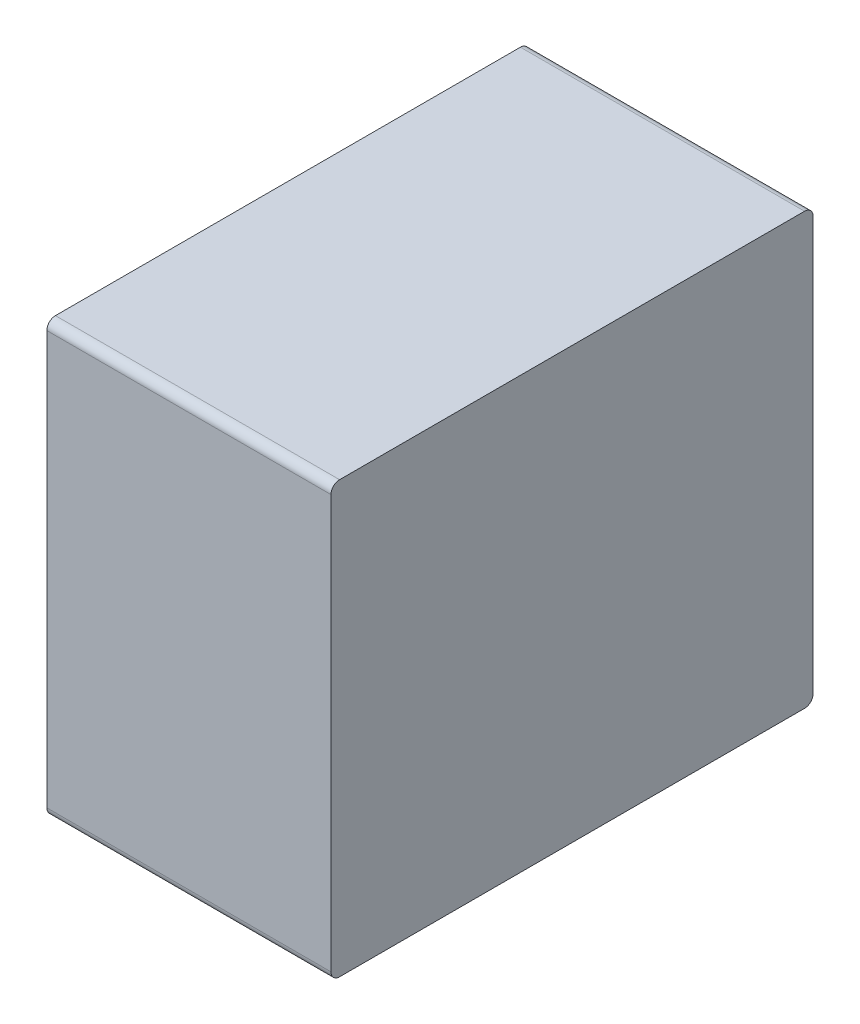
ISO-10303-21;
HEADER;
FILE_DESCRIPTION(('STEP AP214'),'2;1');
FILE_NAME('part.step','',(''),(''),'','','');
FILE_SCHEMA(('AUTOMOTIVE_DESIGN { 1 0 10303 214 1 1 1 1 }'));
ENDSEC;
DATA;
#1=APPLICATION_CONTEXT('core data for automotive mechanical design processes');
#2=APPLICATION_PROTOCOL_DEFINITION('international standard','automotive_design',2000,#1);
#3=PRODUCT_CONTEXT('',#1,'mechanical');
#4=PRODUCT('Part','Part','',(#3));
#5=PRODUCT_RELATED_PRODUCT_CATEGORY('part','',(#4));
#6=PRODUCT_DEFINITION_FORMATION('','',#4);
#7=PRODUCT_DEFINITION_CONTEXT('part definition',#1,'design');
#8=PRODUCT_DEFINITION('design','',#6,#7);
#9=PRODUCT_DEFINITION_SHAPE('','',#8);
#10=(LENGTH_UNIT() NAMED_UNIT(*) SI_UNIT(.MILLI.,.METRE.));
#11=(NAMED_UNIT(*) PLANE_ANGLE_UNIT() SI_UNIT($,.RADIAN.));
#12=(NAMED_UNIT(*) SI_UNIT($,.STERADIAN.) SOLID_ANGLE_UNIT());
#13=UNCERTAINTY_MEASURE_WITH_UNIT(LENGTH_MEASURE(1.E-05),#10,'distance_accuracy_value','');
#14=(GEOMETRIC_REPRESENTATION_CONTEXT(3) GLOBAL_UNCERTAINTY_ASSIGNED_CONTEXT((#13)) GLOBAL_UNIT_ASSIGNED_CONTEXT((#10,
#11,#12)) REPRESENTATION_CONTEXT('',''));
#15=CARTESIAN_POINT('',(0.,0.,0.));
#16=DIRECTION('',(0.,0.,1.));
#17=DIRECTION('',(1.,0.,0.));
#18=AXIS2_PLACEMENT_3D('',#15,#16,#17);
#19=CARTESIAN_POINT('',(0.4125,1.2,0.05));
#20=DIRECTION('',(1.,0.,0.));
#21=DIRECTION('',(0.,0.707106781186548,-0.707106781186547));
#22=AXIS2_PLACEMENT_3D('',#19,#20,#21);
#23=CYLINDRICAL_SURFACE('',#22,0.05);
#24=CARTESIAN_POINT('',(0.825,1.2,0.05));
#25=DIRECTION('',(-1.,0.,0.));
#26=DIRECTION('',(0.,0.707106781186548,-0.707106781186547));
#27=AXIS2_PLACEMENT_3D('',#24,#25,#26);
#28=CIRCLE('',#27,0.05);
#29=CARTESIAN_POINT('',(0.825,1.25,0.05));
#30=VERTEX_POINT('',#29);
#31=CARTESIAN_POINT('',(0.825,1.2,0.));
#32=VERTEX_POINT('',#31);
#33=EDGE_CURVE('E11',#30,#32,#28,.T.);
#34=ORIENTED_EDGE('',*,*,#33,.T.);
#35=DIRECTION('',(-1.,0.,0.));
#36=VECTOR('',#35,1.);
#37=CARTESIAN_POINT('',(0.4125,1.2,0.));
#38=LINE('',#37,#36);
#39=CARTESIAN_POINT('',(-0.825,1.2,0.));
#40=VERTEX_POINT('',#39);
#41=EDGE_CURVE('E24',#32,#40,#38,.T.);
#42=ORIENTED_EDGE('',*,*,#41,.T.);
#43=CARTESIAN_POINT('',(-0.825,1.2,0.05));
#44=DIRECTION('',(1.,0.,0.));
#45=DIRECTION('',(0.,0.707106781186548,-0.707106781186547));
#46=AXIS2_PLACEMENT_3D('',#43,#44,#45);
#47=CIRCLE('',#46,0.05);
#48=CARTESIAN_POINT('',(-0.825,1.25,0.05));
#49=VERTEX_POINT('',#48);
#50=EDGE_CURVE('E142',#40,#49,#47,.T.);
#51=ORIENTED_EDGE('',*,*,#50,.T.);
#52=DIRECTION('',(1.,0.,0.));
#53=VECTOR('',#52,1.);
#54=CARTESIAN_POINT('',(0.4125,1.25,0.05));
#55=LINE('',#54,#53);
#56=EDGE_CURVE('E140',#49,#30,#55,.T.);
#57=ORIENTED_EDGE('',*,*,#56,.T.);
#58=EDGE_LOOP('',(#34,#42,#51,#57));
#59=FACE_BOUND('',#58,.T.);
#60=ADVANCED_FACE('F17',(#59),#23,.T.);
#61=CARTESIAN_POINT('',(0.825,1.25,0.));
#62=DIRECTION('',(0.,1.,0.));
#63=DIRECTION('',(-1.,0.,0.));
#64=AXIS2_PLACEMENT_3D('',#61,#62,#63);
#65=PLANE('',#64);
#66=ORIENTED_EDGE('',*,*,#56,.F.);
#67=DIRECTION('',(0.,0.,1.));
#68=VECTOR('',#67,1.);
#69=CARTESIAN_POINT('',(-0.825,1.25,0.));
#70=LINE('',#69,#68);
#71=CARTESIAN_POINT('',(-0.825,1.25,2.75));
#72=VERTEX_POINT('',#71);
#73=EDGE_CURVE('E138',#49,#72,#70,.T.);
#74=ORIENTED_EDGE('',*,*,#73,.T.);
#75=DIRECTION('',(-1.,0.,0.));
#76=VECTOR('',#75,1.);
#77=CARTESIAN_POINT('',(0.4125,1.25,2.75));
#78=LINE('',#77,#76);
#79=CARTESIAN_POINT('',(0.825,1.25,2.75));
#80=VERTEX_POINT('',#79);
#81=EDGE_CURVE('E135',#80,#72,#78,.T.);
#82=ORIENTED_EDGE('',*,*,#81,.F.);
#83=DIRECTION('',(0.,0.,1.));
#84=VECTOR('',#83,1.);
#85=CARTESIAN_POINT('',(0.825,1.25,0.));
#86=LINE('',#85,#84);
#87=EDGE_CURVE('E133',#30,#80,#86,.T.);
#88=ORIENTED_EDGE('',*,*,#87,.F.);
#89=EDGE_LOOP('',(#66,#74,#82,#88));
#90=FACE_BOUND('',#89,.T.);
#91=ADVANCED_FACE('F163',(#90),#65,.T.);
#92=CARTESIAN_POINT('',(-0.825,1.25,0.));
#93=DIRECTION('',(-1.,0.,0.));
#94=DIRECTION('',(0.,-1.,0.));
#95=AXIS2_PLACEMENT_3D('',#92,#93,#94);
#96=PLANE('',#95);
#97=ORIENTED_EDGE('',*,*,#50,.F.);
#98=DIRECTION('',(0.,1.,0.));
#99=VECTOR('',#98,1.);
#100=CARTESIAN_POINT('',(-0.825,-1.25,0.));
#101=LINE('',#100,#99);
#102=CARTESIAN_POINT('',(-0.825,-1.2,0.));
#103=VERTEX_POINT('',#102);
#104=EDGE_CURVE('E130',#103,#40,#101,.T.);
#105=ORIENTED_EDGE('',*,*,#104,.F.);
#106=CARTESIAN_POINT('',(-0.825,-1.2,0.05));
#107=DIRECTION('',(1.,0.,0.));
#108=DIRECTION('',(0.,-0.707106781186548,-0.707106781186547));
#109=AXIS2_PLACEMENT_3D('',#106,#107,#108);
#110=CIRCLE('',#109,0.05);
#111=CARTESIAN_POINT('',(-0.825,-1.25,0.05));
#112=VERTEX_POINT('',#111);
#113=EDGE_CURVE('E127',#112,#103,#110,.T.);
#114=ORIENTED_EDGE('',*,*,#113,.F.);
#115=DIRECTION('',(0.,0.,1.));
#116=VECTOR('',#115,1.);
#117=CARTESIAN_POINT('',(-0.825,-1.25,0.));
#118=LINE('',#117,#116);
#119=CARTESIAN_POINT('',(-0.825,-1.25,2.75));
#120=VERTEX_POINT('',#119);
#121=EDGE_CURVE('E125',#112,#120,#118,.T.);
#122=ORIENTED_EDGE('',*,*,#121,.T.);
#123=CARTESIAN_POINT('',(-0.825,-1.2,2.75));
#124=DIRECTION('',(1.,0.,0.));
#125=DIRECTION('',(0.,-0.707106781186548,0.707106781186548));
#126=AXIS2_PLACEMENT_3D('',#123,#124,#125);
#127=CIRCLE('',#126,0.05);
#128=CARTESIAN_POINT('',(-0.825,-1.2,2.8));
#129=VERTEX_POINT('',#128);
#130=EDGE_CURVE('E123',#129,#120,#127,.T.);
#131=ORIENTED_EDGE('',*,*,#130,.F.);
#132=DIRECTION('',(0.,-1.,0.));
#133=VECTOR('',#132,1.);
#134=CARTESIAN_POINT('',(-0.825,-1.25,2.8));
#135=LINE('',#134,#133);
#136=CARTESIAN_POINT('',(-0.825,1.2,2.8));
#137=VERTEX_POINT('',#136);
#138=EDGE_CURVE('E101',#137,#129,#135,.T.);
#139=ORIENTED_EDGE('',*,*,#138,.F.);
#140=CARTESIAN_POINT('',(-0.825,1.2,2.75));
#141=DIRECTION('',(1.,0.,0.));
#142=DIRECTION('',(0.,0.707106781186548,0.707106781186548));
#143=AXIS2_PLACEMENT_3D('',#140,#141,#142);
#144=CIRCLE('',#143,0.05);
#145=EDGE_CURVE('E119',#72,#137,#144,.T.);
#146=ORIENTED_EDGE('',*,*,#145,.F.);
#147=ORIENTED_EDGE('',*,*,#73,.F.);
#148=EDGE_LOOP('',(#97,#105,#114,#122,#131,#139,#146,#147));
#149=FACE_BOUND('',#148,.T.);
#150=ADVANCED_FACE('F148',(#149),#96,.T.);
#151=CARTESIAN_POINT('',(-0.4125,-1.2,0.05));
#152=DIRECTION('',(-1.,0.,0.));
#153=DIRECTION('',(0.,-0.707106781186548,-0.707106781186547));
#154=AXIS2_PLACEMENT_3D('',#151,#152,#153);
#155=CYLINDRICAL_SURFACE('',#154,0.05);
#156=ORIENTED_EDGE('',*,*,#113,.T.);
#157=DIRECTION('',(1.,0.,0.));
#158=VECTOR('',#157,1.);
#159=CARTESIAN_POINT('',(-0.4125,-1.2,0.));
#160=LINE('',#159,#158);
#161=CARTESIAN_POINT('',(0.825,-1.2,0.));
#162=VERTEX_POINT('',#161);
#163=EDGE_CURVE('E117',#103,#162,#160,.T.);
#164=ORIENTED_EDGE('',*,*,#163,.T.);
#165=CARTESIAN_POINT('',(0.825,-1.2,0.05));
#166=DIRECTION('',(-1.,0.,0.));
#167=DIRECTION('',(0.,-0.707106781186548,-0.707106781186547));
#168=AXIS2_PLACEMENT_3D('',#165,#166,#167);
#169=CIRCLE('',#168,0.05);
#170=CARTESIAN_POINT('',(0.825,-1.25,0.05));
#171=VERTEX_POINT('',#170);
#172=EDGE_CURVE('E115',#162,#171,#169,.T.);
#173=ORIENTED_EDGE('',*,*,#172,.T.);
#174=DIRECTION('',(-1.,0.,0.));
#175=VECTOR('',#174,1.);
#176=CARTESIAN_POINT('',(-0.4125,-1.25,0.05));
#177=LINE('',#176,#175);
#178=EDGE_CURVE('E112',#171,#112,#177,.T.);
#179=ORIENTED_EDGE('',*,*,#178,.T.);
#180=EDGE_LOOP('',(#156,#164,#173,#179));
#181=FACE_BOUND('',#180,.T.);
#182=ADVANCED_FACE('F154',(#181),#155,.T.);
#183=CARTESIAN_POINT('',(-0.825,-1.25,0.));
#184=DIRECTION('',(0.,-1.,0.));
#185=DIRECTION('',(1.,0.,0.));
#186=AXIS2_PLACEMENT_3D('',#183,#184,#185);
#187=PLANE('',#186);
#188=ORIENTED_EDGE('',*,*,#178,.F.);
#189=DIRECTION('',(0.,0.,1.));
#190=VECTOR('',#189,1.);
#191=CARTESIAN_POINT('',(0.825,-1.25,0.));
#192=LINE('',#191,#190);
#193=CARTESIAN_POINT('',(0.825,-1.25,2.75));
#194=VERTEX_POINT('',#193);
#195=EDGE_CURVE('E110',#171,#194,#192,.T.);
#196=ORIENTED_EDGE('',*,*,#195,.T.);
#197=DIRECTION('',(1.,0.,0.));
#198=VECTOR('',#197,1.);
#199=CARTESIAN_POINT('',(-0.4125,-1.25,2.75));
#200=LINE('',#199,#198);
#201=EDGE_CURVE('E96',#120,#194,#200,.T.);
#202=ORIENTED_EDGE('',*,*,#201,.F.);
#203=ORIENTED_EDGE('',*,*,#121,.F.);
#204=EDGE_LOOP('',(#188,#196,#202,#203));
#205=FACE_BOUND('',#204,.T.);
#206=ADVANCED_FACE('F157',(#205),#187,.T.);
#207=CARTESIAN_POINT('',(0.825,-1.25,0.));
#208=DIRECTION('',(1.,0.,0.));
#209=DIRECTION('',(0.,1.,0.));
#210=AXIS2_PLACEMENT_3D('',#207,#208,#209);
#211=PLANE('',#210);
#212=ORIENTED_EDGE('',*,*,#33,.F.);
#213=ORIENTED_EDGE('',*,*,#87,.T.);
#214=CARTESIAN_POINT('',(0.825,1.2,2.75));
#215=DIRECTION('',(-1.,0.,0.));
#216=DIRECTION('',(0.,0.707106781186548,0.707106781186548));
#217=AXIS2_PLACEMENT_3D('',#214,#215,#216);
#218=CIRCLE('',#217,0.05);
#219=CARTESIAN_POINT('',(0.825,1.2,2.8));
#220=VERTEX_POINT('',#219);
#221=EDGE_CURVE('E83',#220,#80,#218,.T.);
#222=ORIENTED_EDGE('',*,*,#221,.F.);
#223=DIRECTION('',(0.,1.,0.));
#224=VECTOR('',#223,1.);
#225=CARTESIAN_POINT('',(0.825,1.25,2.8));
#226=LINE('',#225,#224);
#227=CARTESIAN_POINT('',(0.825,-1.2,2.8));
#228=VERTEX_POINT('',#227);
#229=EDGE_CURVE('E77',#228,#220,#226,.T.);
#230=ORIENTED_EDGE('',*,*,#229,.F.);
#231=CARTESIAN_POINT('',(0.825,-1.2,2.75));
#232=DIRECTION('',(-1.,0.,0.));
#233=DIRECTION('',(0.,-0.707106781186548,0.707106781186548));
#234=AXIS2_PLACEMENT_3D('',#231,#232,#233);
#235=CIRCLE('',#234,0.05);
#236=EDGE_CURVE('E81',#194,#228,#235,.T.);
#237=ORIENTED_EDGE('',*,*,#236,.F.);
#238=ORIENTED_EDGE('',*,*,#195,.F.);
#239=ORIENTED_EDGE('',*,*,#172,.F.);
#240=DIRECTION('',(0.,-1.,0.));
#241=VECTOR('',#240,1.);
#242=CARTESIAN_POINT('',(0.825,1.25,0.));
#243=LINE('',#242,#241);
#244=EDGE_CURVE('E97',#32,#162,#243,.T.);
#245=ORIENTED_EDGE('',*,*,#244,.F.);
#246=EDGE_LOOP('',(#212,#213,#222,#230,#237,#238,#239,#245));
#247=FACE_BOUND('',#246,.T.);
#248=ADVANCED_FACE('F79',(#247),#211,.T.);
#249=CARTESIAN_POINT('',(0.4125,1.2,2.75));
#250=DIRECTION('',(-1.,0.,0.));
#251=DIRECTION('',(0.,0.707106781186548,0.707106781186548));
#252=AXIS2_PLACEMENT_3D('',#249,#250,#251);
#253=CYLINDRICAL_SURFACE('',#252,0.05);
#254=ORIENTED_EDGE('',*,*,#145,.T.);
#255=DIRECTION('',(1.,0.,0.));
#256=VECTOR('',#255,1.);
#257=CARTESIAN_POINT('',(0.4125,1.2,2.8));
#258=LINE('',#257,#256);
#259=EDGE_CURVE('E102',#137,#220,#258,.T.);
#260=ORIENTED_EDGE('',*,*,#259,.T.);
#261=ORIENTED_EDGE('',*,*,#221,.T.);
#262=ORIENTED_EDGE('',*,*,#81,.T.);
#263=EDGE_LOOP('',(#254,#260,#261,#262));
#264=FACE_BOUND('',#263,.T.);
#265=ADVANCED_FACE('F160',(#264),#253,.T.);
#266=CARTESIAN_POINT('',(0.,0.,2.8));
#267=DIRECTION('',(0.,0.,1.));
#268=DIRECTION('',(1.,0.,0.));
#269=AXIS2_PLACEMENT_3D('',#266,#267,#268);
#270=PLANE('',#269);
#271=ORIENTED_EDGE('',*,*,#259,.F.);
#272=ORIENTED_EDGE('',*,*,#138,.T.);
#273=DIRECTION('',(-1.,0.,0.));
#274=VECTOR('',#273,1.);
#275=CARTESIAN_POINT('',(-0.4125,-1.2,2.8));
#276=LINE('',#275,#274);
#277=EDGE_CURVE('E94',#228,#129,#276,.T.);
#278=ORIENTED_EDGE('',*,*,#277,.F.);
#279=ORIENTED_EDGE('',*,*,#229,.T.);
#280=EDGE_LOOP('',(#271,#272,#278,#279));
#281=FACE_BOUND('',#280,.T.);
#282=ADVANCED_FACE('F100',(#281),#270,.T.);
#283=CARTESIAN_POINT('',(-0.4125,-1.2,2.75));
#284=DIRECTION('',(1.,0.,0.));
#285=DIRECTION('',(0.,-0.707106781186548,0.707106781186548));
#286=AXIS2_PLACEMENT_3D('',#283,#284,#285);
#287=CYLINDRICAL_SURFACE('',#286,0.05);
#288=ORIENTED_EDGE('',*,*,#236,.T.);
#289=ORIENTED_EDGE('',*,*,#277,.T.);
#290=ORIENTED_EDGE('',*,*,#130,.T.);
#291=ORIENTED_EDGE('',*,*,#201,.T.);
#292=EDGE_LOOP('',(#288,#289,#290,#291));
#293=FACE_BOUND('',#292,.T.);
#294=ADVANCED_FACE('F92',(#293),#287,.T.);
#295=CARTESIAN_POINT('',(0.,0.,0.));
#296=DIRECTION('',(0.,0.,1.));
#297=DIRECTION('',(1.,0.,0.));
#298=AXIS2_PLACEMENT_3D('',#295,#296,#297);
#299=PLANE('',#298);
#300=ORIENTED_EDGE('',*,*,#41,.F.);
#301=ORIENTED_EDGE('',*,*,#244,.T.);
#302=ORIENTED_EDGE('',*,*,#163,.F.);
#303=ORIENTED_EDGE('',*,*,#104,.T.);
#304=EDGE_LOOP('',(#300,#301,#302,#303));
#305=FACE_BOUND('',#304,.T.);
#306=ADVANCED_FACE('F151',(#305),#299,.F.);
#307=CLOSED_SHELL('',(#60,#91,#150,#182,#206,#248,#265,#282,#294,#306));
#308=MANIFOLD_SOLID_BREP('B1',#307);
#309=ADVANCED_BREP_SHAPE_REPRESENTATION('',(#18,#308),#14);
#310=SHAPE_DEFINITION_REPRESENTATION(#9,#309);
ENDSEC;
END-ISO-10303-21;
